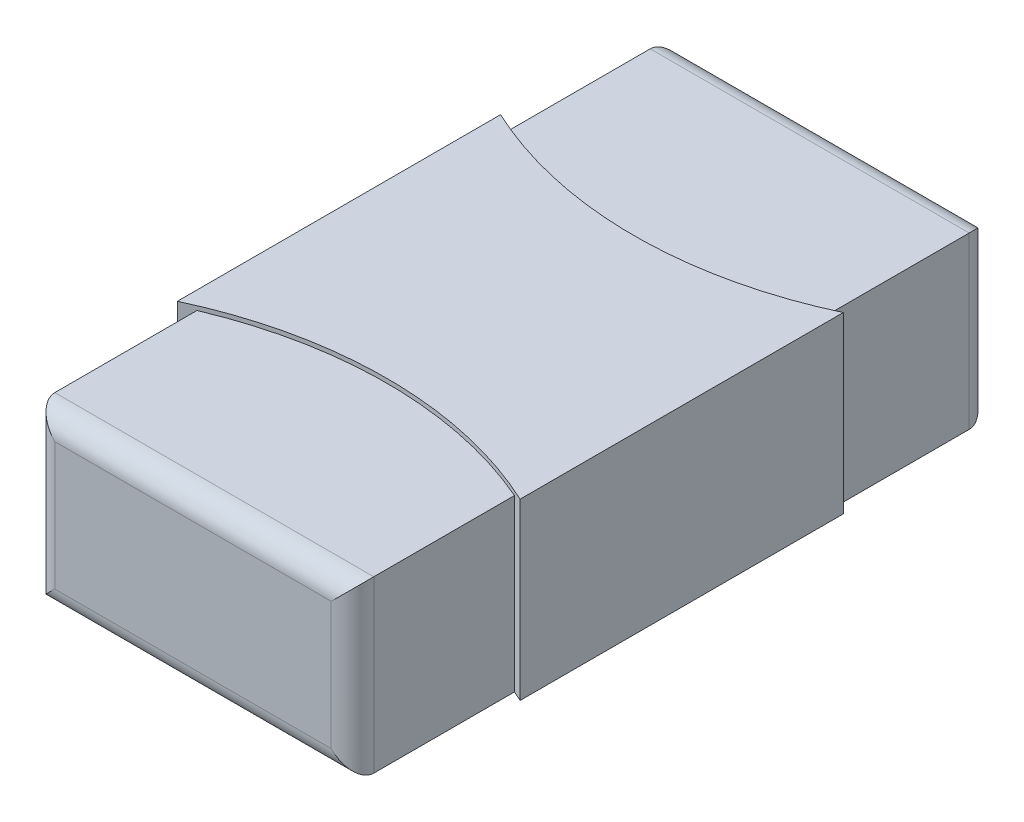
ISO-10303-21;
HEADER;
FILE_DESCRIPTION(('STEP AP214'),'2;1');
FILE_NAME('part.step','',(''),(''),'','','');
FILE_SCHEMA(('AUTOMOTIVE_DESIGN { 1 0 10303 214 1 1 1 1 }'));
ENDSEC;
DATA;
#1=APPLICATION_CONTEXT('core data for automotive mechanical design processes');
#2=APPLICATION_PROTOCOL_DEFINITION('international standard','automotive_design',2000,#1);
#3=PRODUCT_CONTEXT('',#1,'mechanical');
#4=PRODUCT('Part','Part','',(#3));
#5=PRODUCT_RELATED_PRODUCT_CATEGORY('part','',(#4));
#6=PRODUCT_DEFINITION_FORMATION('','',#4);
#7=PRODUCT_DEFINITION_CONTEXT('part definition',#1,'design');
#8=PRODUCT_DEFINITION('design','',#6,#7);
#9=PRODUCT_DEFINITION_SHAPE('','',#8);
#10=(LENGTH_UNIT() NAMED_UNIT(*) SI_UNIT(.MILLI.,.METRE.));
#11=(NAMED_UNIT(*) PLANE_ANGLE_UNIT() SI_UNIT($,.RADIAN.));
#12=(NAMED_UNIT(*) SI_UNIT($,.STERADIAN.) SOLID_ANGLE_UNIT());
#13=UNCERTAINTY_MEASURE_WITH_UNIT(LENGTH_MEASURE(1.E-05),#10,'distance_accuracy_value','');
#14=(GEOMETRIC_REPRESENTATION_CONTEXT(3) GLOBAL_UNCERTAINTY_ASSIGNED_CONTEXT((#13)) GLOBAL_UNIT_ASSIGNED_CONTEXT((#10,
#11,#12)) REPRESENTATION_CONTEXT('',''));
#15=CARTESIAN_POINT('',(0.,0.,0.));
#16=DIRECTION('',(0.,0.,1.));
#17=DIRECTION('',(1.,0.,0.));
#18=AXIS2_PLACEMENT_3D('',#15,#16,#17);
#19=CARTESIAN_POINT('',(-0.75,0.8,1.5));
#20=DIRECTION('',(1.,0.,0.));
#21=DIRECTION('',(0.,0.,-1.));
#22=AXIS2_PLACEMENT_3D('',#19,#20,#21);
#23=PLANE('',#22);
#24=DIRECTION('',(0.,0.,1.));
#25=VECTOR('',#24,1.);
#26=CARTESIAN_POINT('',(-0.75,0.8,1.5));
#27=LINE('',#26,#25);
#28=CARTESIAN_POINT('',(-0.75,0.8,0.731571197232282));
#29=VERTEX_POINT('',#28);
#30=CARTESIAN_POINT('',(-0.75,0.8,1.4));
#31=VERTEX_POINT('',#30);
#32=EDGE_CURVE('E212',#29,#31,#27,.T.);
#33=ORIENTED_EDGE('',*,*,#32,.F.);
#34=DIRECTION('',(0.,1.,0.));
#35=VECTOR('',#34,1.);
#36=CARTESIAN_POINT('',(-0.75,0.,0.731571197232282));
#37=LINE('',#36,#35);
#38=CARTESIAN_POINT('',(-0.75,0.,0.731571197232282));
#39=VERTEX_POINT('',#38);
#40=EDGE_CURVE('E206',#29,#39,#37,.F.);
#41=ORIENTED_EDGE('',*,*,#40,.T.);
#42=DIRECTION('',(0.,0.,1.));
#43=VECTOR('',#42,1.);
#44=CARTESIAN_POINT('',(-0.75,0.,1.5));
#45=LINE('',#44,#43);
#46=CARTESIAN_POINT('',(-0.75,0.,1.4));
#47=VERTEX_POINT('',#46);
#48=EDGE_CURVE('E219',#39,#47,#45,.T.);
#49=ORIENTED_EDGE('',*,*,#48,.T.);
#50=DIRECTION('',(0.,-1.,0.));
#51=VECTOR('',#50,1.);
#52=CARTESIAN_POINT('',(-0.75,0.8,1.4));
#53=LINE('',#52,#51);
#54=EDGE_CURVE('E239',#47,#31,#53,.F.);
#55=ORIENTED_EDGE('',*,*,#54,.T.);
#56=EDGE_LOOP('',(#33,#41,#49,#55));
#57=FACE_BOUND('',#56,.T.);
#58=ADVANCED_FACE('F34',(#57),#23,.F.);
#59=CARTESIAN_POINT('',(0.75,0.8,1.5));
#60=DIRECTION('',(-1.,0.,0.));
#61=DIRECTION('',(0.,0.,1.));
#62=AXIS2_PLACEMENT_3D('',#59,#60,#61);
#63=PLANE('',#62);
#64=DIRECTION('',(0.,0.,-1.));
#65=VECTOR('',#64,1.);
#66=CARTESIAN_POINT('',(0.75,0.,1.5));
#67=LINE('',#66,#65);
#68=CARTESIAN_POINT('',(0.75,0.,1.4));
#69=VERTEX_POINT('',#68);
#70=CARTESIAN_POINT('',(0.75,0.,0.738310490994002));
#71=VERTEX_POINT('',#70);
#72=EDGE_CURVE('E220',#69,#71,#67,.T.);
#73=ORIENTED_EDGE('',*,*,#72,.T.);
#74=DIRECTION('',(0.,1.,0.));
#75=VECTOR('',#74,1.);
#76=CARTESIAN_POINT('',(0.75,0.,0.738310490994002));
#77=LINE('',#76,#75);
#78=CARTESIAN_POINT('',(0.75,0.8,0.738310490994002));
#79=VERTEX_POINT('',#78);
#80=EDGE_CURVE('E204',#71,#79,#77,.T.);
#81=ORIENTED_EDGE('',*,*,#80,.T.);
#82=DIRECTION('',(0.,0.,-1.));
#83=VECTOR('',#82,1.);
#84=CARTESIAN_POINT('',(0.75,0.8,1.5));
#85=LINE('',#84,#83);
#86=CARTESIAN_POINT('',(0.75,0.8,1.4));
#87=VERTEX_POINT('',#86);
#88=EDGE_CURVE('E213',#87,#79,#85,.T.);
#89=ORIENTED_EDGE('',*,*,#88,.F.);
#90=DIRECTION('',(0.,-1.,0.));
#91=VECTOR('',#90,1.);
#92=CARTESIAN_POINT('',(0.75,0.8,1.4));
#93=LINE('',#92,#91);
#94=EDGE_CURVE('E230',#87,#69,#93,.T.);
#95=ORIENTED_EDGE('',*,*,#94,.T.);
#96=EDGE_LOOP('',(#73,#81,#89,#95));
#97=FACE_BOUND('',#96,.T.);
#98=ADVANCED_FACE('F288',(#97),#63,.F.);
#99=CARTESIAN_POINT('',(0.,0.8,0.));
#100=DIRECTION('',(0.,1.,0.));
#101=DIRECTION('',(0.,0.,1.));
#102=AXIS2_PLACEMENT_3D('',#99,#100,#101);
#103=PLANE('',#102);
#104=CARTESIAN_POINT('',(-0.0078623697617996,0.8,2.48490976662681));
#105=DIRECTION('',(0.,1.,0.));
#106=DIRECTION('',(0.,0.,1.));
#107=AXIS2_PLACEMENT_3D('',#104,#105,#106);
#108=CIRCLE('',#107,1.90393392772492);
#109=EDGE_CURVE('E51',#29,#79,#108,.F.);
#110=ORIENTED_EDGE('',*,*,#109,.F.);
#111=ORIENTED_EDGE('',*,*,#32,.T.);
#112=DIRECTION('',(1.,0.,0.));
#113=VECTOR('',#112,1.);
#114=CARTESIAN_POINT('',(0.75,0.8,1.4));
#115=LINE('',#114,#113);
#116=EDGE_CURVE('E235',#31,#87,#115,.T.);
#117=ORIENTED_EDGE('',*,*,#116,.T.);
#118=ORIENTED_EDGE('',*,*,#88,.T.);
#119=EDGE_LOOP('',(#110,#111,#117,#118));
#120=FACE_BOUND('',#119,.T.);
#121=ADVANCED_FACE('F306',(#120),#103,.T.);
#122=CARTESIAN_POINT('',(-0.0078623697617996,0.8,-2.48490976662681));
#123=DIRECTION('',(0.,1.,0.));
#124=DIRECTION('',(0.,0.,1.));
#125=AXIS2_PLACEMENT_3D('',#122,#123,#124);
#126=CIRCLE('',#125,1.90393392772492);
#127=CARTESIAN_POINT('',(0.75,0.8,-0.738310490994002));
#128=VERTEX_POINT('',#127);
#129=CARTESIAN_POINT('',(-0.75,0.8,-0.731571197232282));
#130=VERTEX_POINT('',#129);
#131=EDGE_CURVE('E59',#128,#130,#126,.F.);
#132=ORIENTED_EDGE('',*,*,#131,.F.);
#133=CARTESIAN_POINT('',(0.75,0.8,-1.4));
#134=VERTEX_POINT('',#133);
#135=EDGE_CURVE('E211',#128,#134,#85,.T.);
#136=ORIENTED_EDGE('',*,*,#135,.T.);
#137=DIRECTION('',(-1.,0.,0.));
#138=VECTOR('',#137,1.);
#139=CARTESIAN_POINT('',(-0.75,0.8,-1.4));
#140=LINE('',#139,#138);
#141=CARTESIAN_POINT('',(-0.75,0.8,-1.4));
#142=VERTEX_POINT('',#141);
#143=EDGE_CURVE('E237',#134,#142,#140,.T.);
#144=ORIENTED_EDGE('',*,*,#143,.T.);
#145=EDGE_CURVE('E209',#142,#130,#27,.T.);
#146=ORIENTED_EDGE('',*,*,#145,.T.);
#147=EDGE_LOOP('',(#132,#136,#144,#146));
#148=FACE_BOUND('',#147,.T.);
#149=ADVANCED_FACE('F332',(#148),#103,.T.);
#150=CARTESIAN_POINT('',(-0.75,0.,-1.4));
#151=VERTEX_POINT('',#150);
#152=CARTESIAN_POINT('',(-0.75,0.,-0.731571197232282));
#153=VERTEX_POINT('',#152);
#154=EDGE_CURVE('E216',#151,#153,#45,.T.);
#155=ORIENTED_EDGE('',*,*,#154,.T.);
#156=DIRECTION('',(0.,1.,0.));
#157=VECTOR('',#156,1.);
#158=CARTESIAN_POINT('',(-0.75,0.,-0.731571197232282));
#159=LINE('',#158,#157);
#160=EDGE_CURVE('E200',#153,#130,#159,.T.);
#161=ORIENTED_EDGE('',*,*,#160,.T.);
#162=ORIENTED_EDGE('',*,*,#145,.F.);
#163=DIRECTION('',(0.,-1.,0.));
#164=VECTOR('',#163,1.);
#165=CARTESIAN_POINT('',(-0.75,0.8,-1.4));
#166=LINE('',#165,#164);
#167=EDGE_CURVE('E242',#142,#151,#166,.T.);
#168=ORIENTED_EDGE('',*,*,#167,.T.);
#169=EDGE_LOOP('',(#155,#161,#162,#168));
#170=FACE_BOUND('',#169,.T.);
#171=ADVANCED_FACE('F323',(#170),#23,.F.);
#172=CARTESIAN_POINT('',(0.75,0.8,1.5));
#173=DIRECTION('',(0.,0.,-1.));
#174=DIRECTION('',(-1.,0.,0.));
#175=AXIS2_PLACEMENT_3D('',#172,#173,#174);
#176=PLANE('',#175);
#177=DIRECTION('',(1.,0.,0.));
#178=VECTOR('',#177,1.);
#179=CARTESIAN_POINT('',(-0.75,0.7,1.5));
#180=LINE('',#179,#178);
#181=CARTESIAN_POINT('',(0.65,0.7,1.5));
#182=VERTEX_POINT('',#181);
#183=CARTESIAN_POINT('',(-0.65,0.7,1.5));
#184=VERTEX_POINT('',#183);
#185=EDGE_CURVE('E43',#182,#184,#180,.F.);
#186=ORIENTED_EDGE('',*,*,#185,.T.);
#187=DIRECTION('',(0.,-1.,0.));
#188=VECTOR('',#187,1.);
#189=CARTESIAN_POINT('',(-0.65,0.8,1.5));
#190=LINE('',#189,#188);
#191=CARTESIAN_POINT('',(-0.65,0.1,1.5));
#192=VERTEX_POINT('',#191);
#193=EDGE_CURVE('E11',#184,#192,#190,.T.);
#194=ORIENTED_EDGE('',*,*,#193,.T.);
#195=DIRECTION('',(1.,0.,0.));
#196=VECTOR('',#195,1.);
#197=CARTESIAN_POINT('',(0.75,0.1,1.5));
#198=LINE('',#197,#196);
#199=CARTESIAN_POINT('',(0.65,0.1,1.5));
#200=VERTEX_POINT('',#199);
#201=EDGE_CURVE('E250',#192,#200,#198,.T.);
#202=ORIENTED_EDGE('',*,*,#201,.T.);
#203=DIRECTION('',(0.,-1.,0.));
#204=VECTOR('',#203,1.);
#205=CARTESIAN_POINT('',(0.65,0.8,1.5));
#206=LINE('',#205,#204);
#207=EDGE_CURVE('E252',#200,#182,#206,.F.);
#208=ORIENTED_EDGE('',*,*,#207,.T.);
#209=EDGE_LOOP('',(#186,#194,#202,#208));
#210=FACE_BOUND('',#209,.T.);
#211=ADVANCED_FACE('F312',(#210),#176,.F.);
#212=ORIENTED_EDGE('',*,*,#135,.F.);
#213=DIRECTION('',(0.,1.,0.));
#214=VECTOR('',#213,1.);
#215=CARTESIAN_POINT('',(0.75,0.,-0.738310490994002));
#216=LINE('',#215,#214);
#217=CARTESIAN_POINT('',(0.75,0.,-0.738310490994002));
#218=VERTEX_POINT('',#217);
#219=EDGE_CURVE('E198',#128,#218,#216,.F.);
#220=ORIENTED_EDGE('',*,*,#219,.T.);
#221=CARTESIAN_POINT('',(0.75,0.,-1.4));
#222=VERTEX_POINT('',#221);
#223=EDGE_CURVE('E218',#218,#222,#67,.T.);
#224=ORIENTED_EDGE('',*,*,#223,.T.);
#225=DIRECTION('',(0.,-1.,0.));
#226=VECTOR('',#225,1.);
#227=CARTESIAN_POINT('',(0.75,0.8,-1.4));
#228=LINE('',#227,#226);
#229=EDGE_CURVE('E232',#222,#134,#228,.F.);
#230=ORIENTED_EDGE('',*,*,#229,.T.);
#231=EDGE_LOOP('',(#212,#220,#224,#230));
#232=FACE_BOUND('',#231,.T.);
#233=ADVANCED_FACE('F328',(#232),#63,.F.);
#234=CARTESIAN_POINT('',(0.75,0.8,-1.5));
#235=DIRECTION('',(0.,0.,1.));
#236=DIRECTION('',(1.,0.,0.));
#237=AXIS2_PLACEMENT_3D('',#234,#235,#236);
#238=PLANE('',#237);
#239=DIRECTION('',(-1.,0.,0.));
#240=VECTOR('',#239,1.);
#241=CARTESIAN_POINT('',(0.75,0.7,-1.5));
#242=LINE('',#241,#240);
#243=CARTESIAN_POINT('',(-0.65,0.7,-1.5));
#244=VERTEX_POINT('',#243);
#245=CARTESIAN_POINT('',(0.65,0.7,-1.5));
#246=VERTEX_POINT('',#245);
#247=EDGE_CURVE('E225',#244,#246,#242,.F.);
#248=ORIENTED_EDGE('',*,*,#247,.T.);
#249=DIRECTION('',(0.,-1.,0.));
#250=VECTOR('',#249,1.);
#251=CARTESIAN_POINT('',(0.65,0.8,-1.5));
#252=LINE('',#251,#250);
#253=CARTESIAN_POINT('',(0.65,0.1,-1.5));
#254=VERTEX_POINT('',#253);
#255=EDGE_CURVE('E227',#246,#254,#252,.T.);
#256=ORIENTED_EDGE('',*,*,#255,.T.);
#257=DIRECTION('',(-1.,0.,0.));
#258=VECTOR('',#257,1.);
#259=CARTESIAN_POINT('',(0.75,0.1,-1.5));
#260=LINE('',#259,#258);
#261=CARTESIAN_POINT('',(-0.65,0.1,-1.5));
#262=VERTEX_POINT('',#261);
#263=EDGE_CURVE('E215',#254,#262,#260,.T.);
#264=ORIENTED_EDGE('',*,*,#263,.T.);
#265=DIRECTION('',(0.,-1.,0.));
#266=VECTOR('',#265,1.);
#267=CARTESIAN_POINT('',(-0.65,0.8,-1.5));
#268=LINE('',#267,#266);
#269=EDGE_CURVE('E223',#262,#244,#268,.F.);
#270=ORIENTED_EDGE('',*,*,#269,.T.);
#271=EDGE_LOOP('',(#248,#256,#264,#270));
#272=FACE_BOUND('',#271,.T.);
#273=ADVANCED_FACE('F363',(#272),#238,.F.);
#274=CARTESIAN_POINT('',(0.,0.,0.));
#275=DIRECTION('',(0.,1.,0.));
#276=DIRECTION('',(0.,0.,1.));
#277=AXIS2_PLACEMENT_3D('',#274,#275,#276);
#278=PLANE('',#277);
#279=ORIENTED_EDGE('',*,*,#223,.F.);
#280=CARTESIAN_POINT('',(-0.0078623697617996,0.,-2.48490976662681));
#281=DIRECTION('',(0.,-1.,0.));
#282=DIRECTION('',(0.,0.,1.));
#283=AXIS2_PLACEMENT_3D('',#280,#281,#282);
#284=CIRCLE('',#283,1.90393392772492);
#285=CARTESIAN_POINT('',(0.797952705062105,0.,-0.759909341604089));
#286=VERTEX_POINT('',#285);
#287=EDGE_CURVE('E187',#286,#218,#284,.T.);
#288=ORIENTED_EDGE('',*,*,#287,.F.);
#289=DIRECTION('',(0.,0.,-1.));
#290=VECTOR('',#289,1.);
#291=CARTESIAN_POINT('',(0.797952705062105,0.,-0.759909341604089));
#292=LINE('',#291,#290);
#293=CARTESIAN_POINT('',(0.797952705062105,0.,0.759909341604089));
#294=VERTEX_POINT('',#293);
#295=EDGE_CURVE('E184',#294,#286,#292,.T.);
#296=ORIENTED_EDGE('',*,*,#295,.F.);
#297=CARTESIAN_POINT('',(-0.0078623697617996,0.,2.48490976662681));
#298=DIRECTION('',(0.,-1.,0.));
#299=DIRECTION('',(0.,0.,-1.));
#300=AXIS2_PLACEMENT_3D('',#297,#298,#299);
#301=CIRCLE('',#300,1.90393392772492);
#302=EDGE_CURVE('E158',#71,#294,#301,.T.);
#303=ORIENTED_EDGE('',*,*,#302,.F.);
#304=ORIENTED_EDGE('',*,*,#72,.F.);
#305=DIRECTION('',(1.,0.,0.));
#306=VECTOR('',#305,1.);
#307=CARTESIAN_POINT('',(0.,0.,1.4));
#308=LINE('',#307,#306);
#309=EDGE_CURVE('E244',#69,#47,#308,.F.);
#310=ORIENTED_EDGE('',*,*,#309,.T.);
#311=ORIENTED_EDGE('',*,*,#48,.F.);
#312=CARTESIAN_POINT('',(-0.813673935534636,0.,0.759907702393624));
#313=VERTEX_POINT('',#312);
#314=EDGE_CURVE('E181',#313,#39,#301,.T.);
#315=ORIENTED_EDGE('',*,*,#314,.F.);
#316=DIRECTION('',(0.,0.,1.));
#317=VECTOR('',#316,1.);
#318=CARTESIAN_POINT('',(-0.813673935534636,0.,0.759907702393624));
#319=LINE('',#318,#317);
#320=CARTESIAN_POINT('',(-0.813673935534636,0.,-0.759907702393624));
#321=VERTEX_POINT('',#320);
#322=EDGE_CURVE('E163',#321,#313,#319,.T.);
#323=ORIENTED_EDGE('',*,*,#322,.F.);
#324=EDGE_CURVE('E186',#153,#321,#284,.T.);
#325=ORIENTED_EDGE('',*,*,#324,.F.);
#326=ORIENTED_EDGE('',*,*,#154,.F.);
#327=DIRECTION('',(-1.,0.,0.));
#328=VECTOR('',#327,1.);
#329=CARTESIAN_POINT('',(0.,0.,-1.4));
#330=LINE('',#329,#328);
#331=EDGE_CURVE('E247',#151,#222,#330,.F.);
#332=ORIENTED_EDGE('',*,*,#331,.T.);
#333=EDGE_LOOP('',(#279,#288,#296,#303,#304,#310,#311,#315,#323,#325,#326,#332));
#334=FACE_BOUND('',#333,.T.);
#335=ADVANCED_FACE('F291',(#334),#278,.F.);
#336=CARTESIAN_POINT('',(-0.65,0.8,-1.4));
#337=DIRECTION('',(0.,-1.,0.));
#338=DIRECTION('',(0.,0.,-1.));
#339=AXIS2_PLACEMENT_3D('',#336,#337,#338);
#340=CYLINDRICAL_SURFACE('',#339,0.1);
#341=CARTESIAN_POINT('',(-0.65,0.1,-1.4));
#342=DIRECTION('',(-0.707106781186547,0.707106781186547,0.));
#343=DIRECTION('',(-0.707106781186547,-0.707106781186547,0.));
#344=AXIS2_PLACEMENT_3D('',#341,#342,#343);
#345=ELLIPSE('',#344,0.14142135623731,0.1);
#346=EDGE_CURVE('E260',#151,#262,#345,.F.);
#347=ORIENTED_EDGE('',*,*,#346,.F.);
#348=ORIENTED_EDGE('',*,*,#167,.F.);
#349=CARTESIAN_POINT('',(-0.65,0.7,-1.4));
#350=DIRECTION('',(-0.707106781186547,-0.707106781186547,0.));
#351=DIRECTION('',(0.707106781186547,-0.707106781186547,0.));
#352=AXIS2_PLACEMENT_3D('',#349,#350,#351);
#353=ELLIPSE('',#352,0.14142135623731,0.1);
#354=EDGE_CURVE('E263',#244,#142,#353,.F.);
#355=ORIENTED_EDGE('',*,*,#354,.F.);
#356=ORIENTED_EDGE('',*,*,#269,.F.);
#357=EDGE_LOOP('',(#347,#348,#355,#356));
#358=FACE_BOUND('',#357,.T.);
#359=ADVANCED_FACE('F347',(#358),#340,.T.);
#360=CARTESIAN_POINT('',(0.,0.7,-1.4));
#361=DIRECTION('',(1.,0.,0.));
#362=DIRECTION('',(0.,0.,-1.));
#363=AXIS2_PLACEMENT_3D('',#360,#361,#362);
#364=CYLINDRICAL_SURFACE('',#363,0.1);
#365=ORIENTED_EDGE('',*,*,#354,.T.);
#366=ORIENTED_EDGE('',*,*,#143,.F.);
#367=CARTESIAN_POINT('',(0.65,0.7,-1.4));
#368=DIRECTION('',(0.707106781186547,-0.707106781186547,0.));
#369=DIRECTION('',(0.707106781186547,0.707106781186547,0.));
#370=AXIS2_PLACEMENT_3D('',#367,#368,#369);
#371=ELLIPSE('',#370,0.14142135623731,0.1);
#372=EDGE_CURVE('E257',#246,#134,#371,.T.);
#373=ORIENTED_EDGE('',*,*,#372,.F.);
#374=ORIENTED_EDGE('',*,*,#247,.F.);
#375=EDGE_LOOP('',(#365,#366,#373,#374));
#376=FACE_BOUND('',#375,.T.);
#377=ADVANCED_FACE('F360',(#376),#364,.T.);
#378=CARTESIAN_POINT('',(0.75,0.1,-1.4));
#379=DIRECTION('',(-1.,0.,0.));
#380=DIRECTION('',(0.,0.,1.));
#381=AXIS2_PLACEMENT_3D('',#378,#379,#380);
#382=CYLINDRICAL_SURFACE('',#381,0.1);
#383=ORIENTED_EDGE('',*,*,#346,.T.);
#384=ORIENTED_EDGE('',*,*,#263,.F.);
#385=CARTESIAN_POINT('',(0.65,0.1,-1.4));
#386=DIRECTION('',(-0.707106781186547,-0.707106781186547,0.));
#387=DIRECTION('',(-0.707106781186547,0.707106781186547,0.));
#388=AXIS2_PLACEMENT_3D('',#385,#386,#387);
#389=ELLIPSE('',#388,0.14142135623731,0.1);
#390=EDGE_CURVE('E255',#222,#254,#389,.F.);
#391=ORIENTED_EDGE('',*,*,#390,.F.);
#392=ORIENTED_EDGE('',*,*,#331,.F.);
#393=EDGE_LOOP('',(#383,#384,#391,#392));
#394=FACE_BOUND('',#393,.T.);
#395=ADVANCED_FACE('F352',(#394),#382,.T.);
#396=CARTESIAN_POINT('',(0.65,0.8,-1.4));
#397=DIRECTION('',(0.,-1.,0.));
#398=DIRECTION('',(0.,0.,-1.));
#399=AXIS2_PLACEMENT_3D('',#396,#397,#398);
#400=CYLINDRICAL_SURFACE('',#399,0.1);
#401=ORIENTED_EDGE('',*,*,#372,.T.);
#402=ORIENTED_EDGE('',*,*,#229,.F.);
#403=ORIENTED_EDGE('',*,*,#390,.T.);
#404=ORIENTED_EDGE('',*,*,#255,.F.);
#405=EDGE_LOOP('',(#401,#402,#403,#404));
#406=FACE_BOUND('',#405,.T.);
#407=ADVANCED_FACE('F355',(#406),#400,.T.);
#408=CARTESIAN_POINT('',(0.65,0.8,1.4));
#409=DIRECTION('',(0.,-1.,0.));
#410=DIRECTION('',(0.,0.,-1.));
#411=AXIS2_PLACEMENT_3D('',#408,#409,#410);
#412=CYLINDRICAL_SURFACE('',#411,0.1);
#413=CARTESIAN_POINT('',(0.65,0.1,1.4));
#414=DIRECTION('',(0.707106781186547,0.707106781186547,0.));
#415=DIRECTION('',(0.707106781186547,-0.707106781186547,0.));
#416=AXIS2_PLACEMENT_3D('',#413,#414,#415);
#417=ELLIPSE('',#416,0.14142135623731,0.1);
#418=EDGE_CURVE('E269',#69,#200,#417,.F.);
#419=ORIENTED_EDGE('',*,*,#418,.F.);
#420=ORIENTED_EDGE('',*,*,#94,.F.);
#421=CARTESIAN_POINT('',(0.65,0.7,1.4));
#422=DIRECTION('',(0.707106781186547,-0.707106781186547,0.));
#423=DIRECTION('',(-0.707106781186547,-0.707106781186547,0.));
#424=AXIS2_PLACEMENT_3D('',#421,#422,#423);
#425=ELLIPSE('',#424,0.14142135623731,0.1);
#426=EDGE_CURVE('E38',#182,#87,#425,.F.);
#427=ORIENTED_EDGE('',*,*,#426,.F.);
#428=ORIENTED_EDGE('',*,*,#207,.F.);
#429=EDGE_LOOP('',(#419,#420,#427,#428));
#430=FACE_BOUND('',#429,.T.);
#431=ADVANCED_FACE('F36',(#430),#412,.T.);
#432=CARTESIAN_POINT('',(0.,0.7,1.4));
#433=DIRECTION('',(-1.,0.,0.));
#434=DIRECTION('',(0.,0.,1.));
#435=AXIS2_PLACEMENT_3D('',#432,#433,#434);
#436=CYLINDRICAL_SURFACE('',#435,0.1);
#437=ORIENTED_EDGE('',*,*,#426,.T.);
#438=ORIENTED_EDGE('',*,*,#116,.F.);
#439=CARTESIAN_POINT('',(-0.65,0.7,1.4));
#440=DIRECTION('',(-0.707106781186547,-0.707106781186547,0.));
#441=DIRECTION('',(-0.707106781186547,0.707106781186547,0.));
#442=AXIS2_PLACEMENT_3D('',#439,#440,#441);
#443=ELLIPSE('',#442,0.14142135623731,0.1);
#444=EDGE_CURVE('E267',#184,#31,#443,.T.);
#445=ORIENTED_EDGE('',*,*,#444,.F.);
#446=ORIENTED_EDGE('',*,*,#185,.F.);
#447=EDGE_LOOP('',(#437,#438,#445,#446));
#448=FACE_BOUND('',#447,.T.);
#449=ADVANCED_FACE('F280',(#448),#436,.T.);
#450=CARTESIAN_POINT('',(0.75,0.1,1.4));
#451=DIRECTION('',(1.,0.,0.));
#452=DIRECTION('',(0.,0.,-1.));
#453=AXIS2_PLACEMENT_3D('',#450,#451,#452);
#454=CYLINDRICAL_SURFACE('',#453,0.1);
#455=ORIENTED_EDGE('',*,*,#418,.T.);
#456=ORIENTED_EDGE('',*,*,#201,.F.);
#457=CARTESIAN_POINT('',(-0.65,0.1,1.4));
#458=DIRECTION('',(0.707106781186547,-0.707106781186547,0.));
#459=DIRECTION('',(0.707106781186547,0.707106781186547,0.));
#460=AXIS2_PLACEMENT_3D('',#457,#458,#459);
#461=ELLIPSE('',#460,0.14142135623731,0.1);
#462=EDGE_CURVE('E208',#47,#192,#461,.F.);
#463=ORIENTED_EDGE('',*,*,#462,.F.);
#464=ORIENTED_EDGE('',*,*,#309,.F.);
#465=EDGE_LOOP('',(#455,#456,#463,#464));
#466=FACE_BOUND('',#465,.T.);
#467=ADVANCED_FACE('F313',(#466),#454,.T.);
#468=CARTESIAN_POINT('',(-0.65,0.8,1.4));
#469=DIRECTION('',(0.,-1.,0.));
#470=DIRECTION('',(0.,0.,-1.));
#471=AXIS2_PLACEMENT_3D('',#468,#469,#470);
#472=CYLINDRICAL_SURFACE('',#471,0.1);
#473=ORIENTED_EDGE('',*,*,#444,.T.);
#474=ORIENTED_EDGE('',*,*,#54,.F.);
#475=ORIENTED_EDGE('',*,*,#462,.T.);
#476=ORIENTED_EDGE('',*,*,#193,.F.);
#477=EDGE_LOOP('',(#473,#474,#475,#476));
#478=FACE_BOUND('',#477,.T.);
#479=ADVANCED_FACE('F309',(#478),#472,.T.);
#480=CARTESIAN_POINT('',(-0.0078623697617996,0.,2.48490976662681));
#481=DIRECTION('',(0.,1.,0.));
#482=DIRECTION('',(0.,0.,1.));
#483=AXIS2_PLACEMENT_3D('',#480,#481,#482);
#484=CYLINDRICAL_SURFACE('',#483,1.90393392772492);
#485=ORIENTED_EDGE('',*,*,#40,.F.);
#486=ORIENTED_EDGE('',*,*,#109,.T.);
#487=ORIENTED_EDGE('',*,*,#80,.F.);
#488=ORIENTED_EDGE('',*,*,#302,.T.);
#489=DIRECTION('',(0.,1.,0.));
#490=VECTOR('',#489,1.);
#491=CARTESIAN_POINT('',(0.797952705062105,0.,0.759909341604089));
#492=LINE('',#491,#490);
#493=CARTESIAN_POINT('',(0.797952705062105,0.82,0.759909341604089));
#494=VERTEX_POINT('',#493);
#495=EDGE_CURVE('E150',#294,#494,#492,.T.);
#496=ORIENTED_EDGE('',*,*,#495,.T.);
#497=CARTESIAN_POINT('',(-0.0078623697617996,0.82,2.48490976662681));
#498=DIRECTION('',(0.,-1.,0.));
#499=DIRECTION('',(0.,0.,-1.));
#500=AXIS2_PLACEMENT_3D('',#497,#498,#499);
#501=CIRCLE('',#500,1.90393392772492);
#502=CARTESIAN_POINT('',(-0.813673935534636,0.82,0.759907702393624));
#503=VERTEX_POINT('',#502);
#504=EDGE_CURVE('E155',#503,#494,#501,.T.);
#505=ORIENTED_EDGE('',*,*,#504,.F.);
#506=DIRECTION('',(0.,1.,0.));
#507=VECTOR('',#506,1.);
#508=CARTESIAN_POINT('',(-0.813673935534636,0.,0.759907702393624));
#509=LINE('',#508,#507);
#510=EDGE_CURVE('E192',#313,#503,#509,.T.);
#511=ORIENTED_EDGE('',*,*,#510,.F.);
#512=ORIENTED_EDGE('',*,*,#314,.T.);
#513=EDGE_LOOP('',(#485,#486,#487,#488,#496,#505,#511,#512));
#514=FACE_BOUND('',#513,.T.);
#515=ADVANCED_FACE('F153',(#514),#484,.F.);
#516=CARTESIAN_POINT('',(-0.0078623697617996,0.,-2.48490976662681));
#517=DIRECTION('',(0.,1.,0.));
#518=DIRECTION('',(0.,0.,1.));
#519=AXIS2_PLACEMENT_3D('',#516,#517,#518);
#520=CYLINDRICAL_SURFACE('',#519,1.90393392772492);
#521=ORIENTED_EDGE('',*,*,#160,.F.);
#522=ORIENTED_EDGE('',*,*,#324,.T.);
#523=DIRECTION('',(0.,1.,0.));
#524=VECTOR('',#523,1.);
#525=CARTESIAN_POINT('',(-0.813673935534636,0.,-0.759907702393624));
#526=LINE('',#525,#524);
#527=CARTESIAN_POINT('',(-0.813673935534636,0.82,-0.759907702393624));
#528=VERTEX_POINT('',#527);
#529=EDGE_CURVE('E194',#321,#528,#526,.T.);
#530=ORIENTED_EDGE('',*,*,#529,.T.);
#531=CARTESIAN_POINT('',(-0.0078623697617996,0.82,-2.48490976662681));
#532=DIRECTION('',(0.,-1.,0.));
#533=DIRECTION('',(0.,0.,1.));
#534=AXIS2_PLACEMENT_3D('',#531,#532,#533);
#535=CIRCLE('',#534,1.90393392772492);
#536=CARTESIAN_POINT('',(0.797952705062105,0.82,-0.759909341604089));
#537=VERTEX_POINT('',#536);
#538=EDGE_CURVE('E171',#537,#528,#535,.T.);
#539=ORIENTED_EDGE('',*,*,#538,.F.);
#540=DIRECTION('',(0.,1.,0.));
#541=VECTOR('',#540,1.);
#542=CARTESIAN_POINT('',(0.797952705062105,0.,-0.759909341604089));
#543=LINE('',#542,#541);
#544=EDGE_CURVE('E162',#286,#537,#543,.T.);
#545=ORIENTED_EDGE('',*,*,#544,.F.);
#546=ORIENTED_EDGE('',*,*,#287,.T.);
#547=ORIENTED_EDGE('',*,*,#219,.F.);
#548=ORIENTED_EDGE('',*,*,#131,.T.);
#549=EDGE_LOOP('',(#521,#522,#530,#539,#545,#546,#547,#548));
#550=FACE_BOUND('',#549,.T.);
#551=ADVANCED_FACE('F298',(#550),#520,.F.);
#552=CARTESIAN_POINT('',(-0.813673935534636,0.,0.759907702393624));
#553=DIRECTION('',(-1.,0.,0.));
#554=DIRECTION('',(0.,0.,1.));
#555=AXIS2_PLACEMENT_3D('',#552,#553,#554);
#556=PLANE('',#555);
#557=ORIENTED_EDGE('',*,*,#510,.T.);
#558=DIRECTION('',(0.,0.,1.));
#559=VECTOR('',#558,1.);
#560=CARTESIAN_POINT('',(-0.813673935534636,0.82,0.759907702393624));
#561=LINE('',#560,#559);
#562=EDGE_CURVE('E176',#528,#503,#561,.T.);
#563=ORIENTED_EDGE('',*,*,#562,.F.);
#564=ORIENTED_EDGE('',*,*,#529,.F.);
#565=ORIENTED_EDGE('',*,*,#322,.T.);
#566=EDGE_LOOP('',(#557,#563,#564,#565));
#567=FACE_BOUND('',#566,.T.);
#568=ADVANCED_FACE('F301',(#567),#556,.T.);
#569=CARTESIAN_POINT('',(0.797952705062105,0.,-0.759909341604089));
#570=DIRECTION('',(1.,0.,0.));
#571=DIRECTION('',(0.,0.,-1.));
#572=AXIS2_PLACEMENT_3D('',#569,#570,#571);
#573=PLANE('',#572);
#574=ORIENTED_EDGE('',*,*,#544,.T.);
#575=DIRECTION('',(0.,0.,-1.));
#576=VECTOR('',#575,1.);
#577=CARTESIAN_POINT('',(0.797952705062105,0.82,-0.759909341604089));
#578=LINE('',#577,#576);
#579=EDGE_CURVE('E166',#494,#537,#578,.T.);
#580=ORIENTED_EDGE('',*,*,#579,.F.);
#581=ORIENTED_EDGE('',*,*,#495,.F.);
#582=ORIENTED_EDGE('',*,*,#295,.T.);
#583=EDGE_LOOP('',(#574,#580,#581,#582));
#584=FACE_BOUND('',#583,.T.);
#585=ADVANCED_FACE('F167',(#584),#573,.T.);
#586=CARTESIAN_POINT('',(-0.0078623697617996,0.82,2.48490976662681));
#587=DIRECTION('',(0.,-1.,0.));
#588=DIRECTION('',(0.,0.,-1.));
#589=AXIS2_PLACEMENT_3D('',#586,#587,#588);
#590=PLANE('',#589);
#591=ORIENTED_EDGE('',*,*,#504,.T.);
#592=ORIENTED_EDGE('',*,*,#579,.T.);
#593=ORIENTED_EDGE('',*,*,#538,.T.);
#594=ORIENTED_EDGE('',*,*,#562,.T.);
#595=EDGE_LOOP('',(#591,#592,#593,#594));
#596=FACE_BOUND('',#595,.T.);
#597=ADVANCED_FACE('F174',(#596),#590,.F.);
#598=CLOSED_SHELL('',(#58,#98,#121,#149,#171,#211,#233,#273,#335,#359,#377,#395,#407,#431,#449,
#467,#479,#515,#551,#568,#585,#597));
#599=MANIFOLD_SOLID_BREP('B2',#598);
#600=ADVANCED_BREP_SHAPE_REPRESENTATION('',(#18,#599),#14);
#601=SHAPE_DEFINITION_REPRESENTATION(#9,#600);
ENDSEC;
END-ISO-10303-21;
